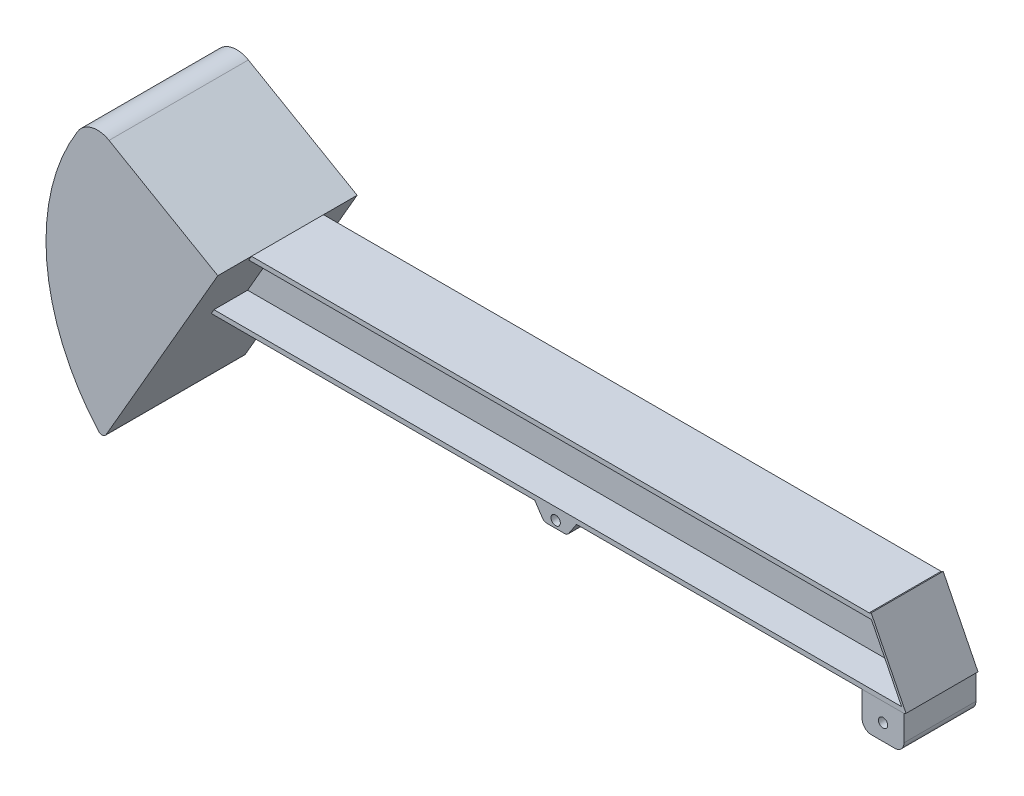
ISO-10303-21;
HEADER;
FILE_DESCRIPTION(('STEP AP214'),'2;1');
FILE_NAME('part.step','',(''),(''),'','','');
FILE_SCHEMA(('AUTOMOTIVE_DESIGN { 1 0 10303 214 1 1 1 1 }'));
ENDSEC;
DATA;
#1=APPLICATION_CONTEXT('core data for automotive mechanical design processes');
#2=APPLICATION_PROTOCOL_DEFINITION('international standard','automotive_design',2000,#1);
#3=PRODUCT_CONTEXT('',#1,'mechanical');
#4=PRODUCT('Part','Part','',(#3));
#5=PRODUCT_RELATED_PRODUCT_CATEGORY('part','',(#4));
#6=PRODUCT_DEFINITION_FORMATION('','',#4);
#7=PRODUCT_DEFINITION_CONTEXT('part definition',#1,'design');
#8=PRODUCT_DEFINITION('design','',#6,#7);
#9=PRODUCT_DEFINITION_SHAPE('','',#8);
#10=(LENGTH_UNIT() NAMED_UNIT(*) SI_UNIT(.MILLI.,.METRE.));
#11=(NAMED_UNIT(*) PLANE_ANGLE_UNIT() SI_UNIT($,.RADIAN.));
#12=(NAMED_UNIT(*) SI_UNIT($,.STERADIAN.) SOLID_ANGLE_UNIT());
#13=UNCERTAINTY_MEASURE_WITH_UNIT(LENGTH_MEASURE(1.E-05),#10,'distance_accuracy_value','');
#14=(GEOMETRIC_REPRESENTATION_CONTEXT(3) GLOBAL_UNCERTAINTY_ASSIGNED_CONTEXT((#13)) GLOBAL_UNIT_ASSIGNED_CONTEXT((#10,
#11,#12)) REPRESENTATION_CONTEXT('',''));
#15=CARTESIAN_POINT('',(0.,0.,0.));
#16=DIRECTION('',(0.,0.,1.));
#17=DIRECTION('',(1.,0.,0.));
#18=AXIS2_PLACEMENT_3D('',#15,#16,#17);
#19=CARTESIAN_POINT('',(-750.,140.,-77.5));
#20=DIRECTION('',(0.,0.,-1.));
#21=DIRECTION('',(-1.,0.,0.));
#22=AXIS2_PLACEMENT_3D('',#19,#20,#21);
#23=PLANE('',#22);
#24=CARTESIAN_POINT('',(705.,-40.,-77.5));
#25=DIRECTION('',(0.,0.,-1.));
#26=DIRECTION('',(-1.,0.,0.));
#27=AXIS2_PLACEMENT_3D('',#24,#25,#26);
#28=CIRCLE('',#27,9.99999999999998);
#29=CARTESIAN_POINT('',(695.,-40.,-77.5));
#30=VERTEX_POINT('',#29);
#31=EDGE_CURVE('E160',#30,#30,#28,.T.);
#32=ORIENTED_EDGE('',*,*,#31,.F.);
#33=EDGE_LOOP('',(#32));
#34=FACE_BOUND('',#33,.T.);
#35=DIRECTION('',(1.,0.,0.));
#36=VECTOR('',#35,1.);
#37=CARTESIAN_POINT('',(660.,-75.,-77.5));
#38=LINE('',#37,#36);
#39=CARTESIAN_POINT('',(680.,-75.,-77.5));
#40=VERTEX_POINT('',#39);
#41=CARTESIAN_POINT('',(730.,-75.,-77.5));
#42=VERTEX_POINT('',#41);
#43=EDGE_CURVE('E111',#40,#42,#38,.T.);
#44=ORIENTED_EDGE('',*,*,#43,.F.);
#45=CARTESIAN_POINT('',(680.,-55.,-77.5));
#46=DIRECTION('',(0.,0.,-1.));
#47=DIRECTION('',(-1.,0.,0.));
#48=AXIS2_PLACEMENT_3D('',#45,#46,#47);
#49=CIRCLE('',#48,20.);
#50=CARTESIAN_POINT('',(660.,-55.,-77.5));
#51=VERTEX_POINT('',#50);
#52=EDGE_CURVE('E58',#40,#51,#49,.T.);
#53=ORIENTED_EDGE('',*,*,#52,.T.);
#54=DIRECTION('',(0.,-1.,0.));
#55=VECTOR('',#54,1.);
#56=CARTESIAN_POINT('',(660.,0.,-77.5));
#57=LINE('',#56,#55);
#58=CARTESIAN_POINT('',(660.,0.,-77.5));
#59=VERTEX_POINT('',#58);
#60=EDGE_CURVE('E102',#59,#51,#57,.T.);
#61=ORIENTED_EDGE('',*,*,#60,.F.);
#62=DIRECTION('',(-1.,0.,0.));
#63=VECTOR('',#62,1.);
#64=CARTESIAN_POINT('',(750.,0.,-77.5));
#65=LINE('',#64,#63);
#66=CARTESIAN_POINT('',(750.,0.,-77.5));
#67=VERTEX_POINT('',#66);
#68=EDGE_CURVE('E105',#67,#59,#65,.T.);
#69=ORIENTED_EDGE('',*,*,#68,.F.);
#70=DIRECTION('',(0.,1.,0.));
#71=VECTOR('',#70,1.);
#72=CARTESIAN_POINT('',(750.,-75.,-77.5));
#73=LINE('',#72,#71);
#74=CARTESIAN_POINT('',(750.,-55.,-77.5));
#75=VERTEX_POINT('',#74);
#76=EDGE_CURVE('E133',#75,#67,#73,.T.);
#77=ORIENTED_EDGE('',*,*,#76,.F.);
#78=CARTESIAN_POINT('',(730.,-55.,-77.5));
#79=DIRECTION('',(0.,0.,-1.));
#80=DIRECTION('',(-1.,0.,0.));
#81=AXIS2_PLACEMENT_3D('',#78,#79,#80);
#82=CIRCLE('',#81,20.);
#83=EDGE_CURVE('E70',#75,#42,#82,.T.);
#84=ORIENTED_EDGE('',*,*,#83,.T.);
#85=EDGE_LOOP('',(#44,#53,#61,#69,#77,#84));
#86=FACE_BOUND('',#85,.T.);
#87=ADVANCED_FACE('F50',(#34,#86),#23,.T.);
#88=CARTESIAN_POINT('',(0.,0.,77.5));
#89=DIRECTION('',(0.,0.,1.));
#90=DIRECTION('',(1.,0.,0.));
#91=AXIS2_PLACEMENT_3D('',#88,#89,#90);
#92=PLANE('',#91);
#93=CARTESIAN_POINT('',(705.,-40.,77.5));
#94=DIRECTION('',(0.,0.,1.));
#95=DIRECTION('',(1.,0.,0.));
#96=AXIS2_PLACEMENT_3D('',#93,#94,#95);
#97=CIRCLE('',#96,9.99999999999998);
#98=CARTESIAN_POINT('',(715.,-40.,77.5));
#99=VERTEX_POINT('',#98);
#100=EDGE_CURVE('E163',#99,#99,#97,.T.);
#101=ORIENTED_EDGE('',*,*,#100,.F.);
#102=EDGE_LOOP('',(#101));
#103=FACE_BOUND('',#102,.T.);
#104=DIRECTION('',(0.,-1.,0.));
#105=VECTOR('',#104,1.);
#106=CARTESIAN_POINT('',(660.,0.,77.5));
#107=LINE('',#106,#105);
#108=CARTESIAN_POINT('',(660.,0.,77.5));
#109=VERTEX_POINT('',#108);
#110=CARTESIAN_POINT('',(660.,-55.,77.5));
#111=VERTEX_POINT('',#110);
#112=EDGE_CURVE('E117',#109,#111,#107,.T.);
#113=ORIENTED_EDGE('',*,*,#112,.T.);
#114=CARTESIAN_POINT('',(680.,-55.,77.5));
#115=DIRECTION('',(0.,0.,1.));
#116=DIRECTION('',(1.,0.,0.));
#117=AXIS2_PLACEMENT_3D('',#114,#115,#116);
#118=CIRCLE('',#117,20.);
#119=CARTESIAN_POINT('',(680.,-75.,77.5));
#120=VERTEX_POINT('',#119);
#121=EDGE_CURVE('E141',#111,#120,#118,.T.);
#122=ORIENTED_EDGE('',*,*,#121,.T.);
#123=DIRECTION('',(1.,0.,0.));
#124=VECTOR('',#123,1.);
#125=CARTESIAN_POINT('',(660.,-75.,77.5));
#126=LINE('',#125,#124);
#127=CARTESIAN_POINT('',(730.,-75.,77.5));
#128=VERTEX_POINT('',#127);
#129=EDGE_CURVE('E125',#120,#128,#126,.T.);
#130=ORIENTED_EDGE('',*,*,#129,.T.);
#131=CARTESIAN_POINT('',(730.,-55.,77.5));
#132=DIRECTION('',(0.,0.,1.));
#133=DIRECTION('',(1.,0.,0.));
#134=AXIS2_PLACEMENT_3D('',#131,#132,#133);
#135=CIRCLE('',#134,20.);
#136=CARTESIAN_POINT('',(750.,-55.,77.5));
#137=VERTEX_POINT('',#136);
#138=EDGE_CURVE('E139',#128,#137,#135,.T.);
#139=ORIENTED_EDGE('',*,*,#138,.T.);
#140=DIRECTION('',(0.,1.,0.));
#141=VECTOR('',#140,1.);
#142=CARTESIAN_POINT('',(750.,-75.,77.5));
#143=LINE('',#142,#141);
#144=CARTESIAN_POINT('',(750.,0.,77.5));
#145=VERTEX_POINT('',#144);
#146=EDGE_CURVE('E131',#137,#145,#143,.T.);
#147=ORIENTED_EDGE('',*,*,#146,.T.);
#148=DIRECTION('',(-1.,0.,0.));
#149=VECTOR('',#148,1.);
#150=CARTESIAN_POINT('',(750.,0.,77.5));
#151=LINE('',#150,#149);
#152=EDGE_CURVE('E157',#145,#109,#151,.T.);
#153=ORIENTED_EDGE('',*,*,#152,.T.);
#154=EDGE_LOOP('',(#113,#122,#130,#139,#147,#153));
#155=FACE_BOUND('',#154,.T.);
#156=ADVANCED_FACE('F156',(#103,#155),#92,.T.);
#157=CARTESIAN_POINT('',(750.,0.,-194.6537451386));
#158=DIRECTION('',(0.,1.,0.));
#159=DIRECTION('',(-1.,0.,0.));
#160=AXIS2_PLACEMENT_3D('',#157,#158,#159);
#161=PLANE('',#160);
#162=DIRECTION('',(0.,0.,1.));
#163=VECTOR('',#162,1.);
#164=CARTESIAN_POINT('',(750.,0.,-194.6537451386));
#165=LINE('',#164,#163);
#166=EDGE_CURVE('E124',#67,#145,#165,.T.);
#167=ORIENTED_EDGE('',*,*,#166,.F.);
#168=ORIENTED_EDGE('',*,*,#68,.T.);
#169=DIRECTION('',(0.,0.,1.));
#170=VECTOR('',#169,1.);
#171=CARTESIAN_POINT('',(660.,0.,-194.6537451386));
#172=LINE('',#171,#170);
#173=EDGE_CURVE('E112',#59,#109,#172,.T.);
#174=ORIENTED_EDGE('',*,*,#173,.T.);
#175=ORIENTED_EDGE('',*,*,#152,.F.);
#176=EDGE_LOOP('',(#167,#168,#174,#175));
#177=FACE_BOUND('',#176,.T.);
#178=ADVANCED_FACE('F122',(#177),#161,.T.);
#179=CARTESIAN_POINT('',(660.,0.,-194.6537451386));
#180=DIRECTION('',(-1.,0.,0.));
#181=DIRECTION('',(0.,0.,1.));
#182=AXIS2_PLACEMENT_3D('',#179,#180,#181);
#183=PLANE('',#182);
#184=ORIENTED_EDGE('',*,*,#60,.T.);
#185=DIRECTION('',(0.,0.,1.));
#186=VECTOR('',#185,1.);
#187=CARTESIAN_POINT('',(660.,-55.,-194.6537451386));
#188=LINE('',#187,#186);
#189=EDGE_CURVE('E137',#51,#111,#188,.T.);
#190=ORIENTED_EDGE('',*,*,#189,.T.);
#191=ORIENTED_EDGE('',*,*,#112,.F.);
#192=ORIENTED_EDGE('',*,*,#173,.F.);
#193=EDGE_LOOP('',(#184,#190,#191,#192));
#194=FACE_BOUND('',#193,.T.);
#195=ADVANCED_FACE('F115',(#194),#183,.T.);
#196=CARTESIAN_POINT('',(660.,-75.,-194.6537451386));
#197=DIRECTION('',(0.,-1.,0.));
#198=DIRECTION('',(0.,0.,-1.));
#199=AXIS2_PLACEMENT_3D('',#196,#197,#198);
#200=PLANE('',#199);
#201=ORIENTED_EDGE('',*,*,#129,.F.);
#202=DIRECTION('',(0.,0.,1.));
#203=VECTOR('',#202,1.);
#204=CARTESIAN_POINT('',(680.,-75.,-194.6537451386));
#205=LINE('',#204,#203);
#206=EDGE_CURVE('E146',#120,#40,#205,.F.);
#207=ORIENTED_EDGE('',*,*,#206,.T.);
#208=ORIENTED_EDGE('',*,*,#43,.T.);
#209=DIRECTION('',(0.,0.,1.));
#210=VECTOR('',#209,1.);
#211=CARTESIAN_POINT('',(730.,-75.,-194.6537451386));
#212=LINE('',#211,#210);
#213=EDGE_CURVE('E143',#42,#128,#212,.T.);
#214=ORIENTED_EDGE('',*,*,#213,.T.);
#215=EDGE_LOOP('',(#201,#207,#208,#214));
#216=FACE_BOUND('',#215,.T.);
#217=ADVANCED_FACE('F151',(#216),#200,.T.);
#218=CARTESIAN_POINT('',(750.,-75.,-194.6537451386));
#219=DIRECTION('',(1.,0.,0.));
#220=DIRECTION('',(0.,0.,-1.));
#221=AXIS2_PLACEMENT_3D('',#218,#219,#220);
#222=PLANE('',#221);
#223=ORIENTED_EDGE('',*,*,#146,.F.);
#224=DIRECTION('',(0.,0.,1.));
#225=VECTOR('',#224,1.);
#226=CARTESIAN_POINT('',(750.,-55.,-194.6537451386));
#227=LINE('',#226,#225);
#228=EDGE_CURVE('E12',#137,#75,#227,.F.);
#229=ORIENTED_EDGE('',*,*,#228,.T.);
#230=ORIENTED_EDGE('',*,*,#76,.T.);
#231=ORIENTED_EDGE('',*,*,#166,.T.);
#232=EDGE_LOOP('',(#223,#229,#230,#231));
#233=FACE_BOUND('',#232,.T.);
#234=ADVANCED_FACE('F180',(#233),#222,.T.);
#235=CARTESIAN_POINT('',(680.,-55.,-194.6537451386));
#236=DIRECTION('',(0.,0.,1.));
#237=DIRECTION('',(1.,0.,0.));
#238=AXIS2_PLACEMENT_3D('',#235,#236,#237);
#239=CYLINDRICAL_SURFACE('',#238,20.);
#240=ORIENTED_EDGE('',*,*,#52,.F.);
#241=ORIENTED_EDGE('',*,*,#206,.F.);
#242=ORIENTED_EDGE('',*,*,#121,.F.);
#243=ORIENTED_EDGE('',*,*,#189,.F.);
#244=EDGE_LOOP('',(#240,#241,#242,#243));
#245=FACE_BOUND('',#244,.T.);
#246=ADVANCED_FACE('F154',(#245),#239,.T.);
#247=CARTESIAN_POINT('',(730.,-55.,-194.6537451386));
#248=DIRECTION('',(0.,0.,1.));
#249=DIRECTION('',(1.,0.,0.));
#250=AXIS2_PLACEMENT_3D('',#247,#248,#249);
#251=CYLINDRICAL_SURFACE('',#250,20.);
#252=ORIENTED_EDGE('',*,*,#83,.F.);
#253=ORIENTED_EDGE('',*,*,#228,.F.);
#254=ORIENTED_EDGE('',*,*,#138,.F.);
#255=ORIENTED_EDGE('',*,*,#213,.F.);
#256=EDGE_LOOP('',(#252,#253,#254,#255));
#257=FACE_BOUND('',#256,.T.);
#258=ADVANCED_FACE('F52',(#257),#251,.T.);
#259=CARTESIAN_POINT('',(705.,-40.,-150.));
#260=DIRECTION('',(0.,0.,1.));
#261=DIRECTION('',(1.,0.,0.));
#262=AXIS2_PLACEMENT_3D('',#259,#260,#261);
#263=CYLINDRICAL_SURFACE('',#262,9.99999999999998);
#264=ORIENTED_EDGE('',*,*,#31,.T.);
#265=EDGE_LOOP('',(#264));
#266=FACE_BOUND('',#265,.T.);
#267=ORIENTED_EDGE('',*,*,#100,.T.);
#268=EDGE_LOOP('',(#267));
#269=FACE_BOUND('',#268,.T.);
#270=ADVANCED_FACE('F167',(#266,#269),#263,.F.);
#271=CLOSED_SHELL('',(#87,#156,#178,#195,#217,#234,#246,#258,#270));
#272=MANIFOLD_SOLID_BREP('B2',#271);
#273=CARTESIAN_POINT('',(-750.,0.,77.5));
#274=DIRECTION('',(0.,-1.,0.));
#275=DIRECTION('',(0.,0.,-1.));
#276=AXIS2_PLACEMENT_3D('',#273,#274,#275);
#277=PLANE('',#276);
#278=DIRECTION('',(1.,0.,0.));
#279=VECTOR('',#278,1.);
#280=CARTESIAN_POINT('',(-750.,0.,77.5));
#281=LINE('',#280,#279);
#282=CARTESIAN_POINT('',(-741.602540378445,0.,77.5));
#283=VERTEX_POINT('',#282);
#284=CARTESIAN_POINT('',(-45.,0.,77.5));
#285=VERTEX_POINT('',#284);
#286=EDGE_CURVE('E551',#283,#285,#281,.T.);
#287=ORIENTED_EDGE('',*,*,#286,.F.);
#288=DIRECTION('',(0.,0.,-1.));
#289=VECTOR('',#288,1.);
#290=CARTESIAN_POINT('',(-741.602540378445,0.,77.5));
#291=LINE('',#290,#289);
#292=CARTESIAN_POINT('',(-741.602540378445,0.,-77.5));
#293=VERTEX_POINT('',#292);
#294=EDGE_CURVE('E501',#283,#293,#291,.T.);
#295=ORIENTED_EDGE('',*,*,#294,.T.);
#296=DIRECTION('',(1.,0.,0.));
#297=VECTOR('',#296,1.);
#298=CARTESIAN_POINT('',(-750.,0.,-77.5));
#299=LINE('',#298,#297);
#300=CARTESIAN_POINT('',(-45.,0.,-77.5));
#301=VERTEX_POINT('',#300);
#302=EDGE_CURVE('E548',#293,#301,#299,.T.);
#303=ORIENTED_EDGE('',*,*,#302,.T.);
#304=DIRECTION('',(0.,0.,-1.));
#305=VECTOR('',#304,1.);
#306=CARTESIAN_POINT('',(-45.,0.,77.5));
#307=LINE('',#306,#305);
#308=EDGE_CURVE('E568',#285,#301,#307,.T.);
#309=ORIENTED_EDGE('',*,*,#308,.F.);
#310=EDGE_LOOP('',(#287,#295,#303,#309));
#311=FACE_BOUND('',#310,.T.);
#312=ADVANCED_FACE('F250',(#311),#277,.T.);
#313=CARTESIAN_POINT('',(-750.,9.99999999999999,5.));
#314=DIRECTION('',(0.,1.,0.));
#315=DIRECTION('',(0.,0.,1.));
#316=AXIS2_PLACEMENT_3D('',#313,#314,#315);
#317=PLANE('',#316);
#318=DIRECTION('',(0.,0.,1.));
#319=VECTOR('',#318,1.);
#320=CARTESIAN_POINT('',(745.,9.99999999999999,4.99999999999991));
#321=LINE('',#320,#319);
#322=CARTESIAN_POINT('',(745.,10.,5.));
#323=VERTEX_POINT('',#322);
#324=CARTESIAN_POINT('',(745.,9.99999999999998,77.5));
#325=VERTEX_POINT('',#324);
#326=EDGE_CURVE('E468',#323,#325,#321,.T.);
#327=ORIENTED_EDGE('',*,*,#326,.F.);
#328=DIRECTION('',(1.,0.,0.));
#329=VECTOR('',#328,1.);
#330=CARTESIAN_POINT('',(-750.,9.99999999999999,5.));
#331=LINE('',#330,#329);
#332=CARTESIAN_POINT('',(-735.829037686549,9.99999999999999,5.));
#333=VERTEX_POINT('',#332);
#334=EDGE_CURVE('E524',#333,#323,#331,.T.);
#335=ORIENTED_EDGE('',*,*,#334,.F.);
#336=DIRECTION('',(0.,0.,1.));
#337=VECTOR('',#336,1.);
#338=CARTESIAN_POINT('',(-735.829037686549,9.99999999999999,5.));
#339=LINE('',#338,#337);
#340=CARTESIAN_POINT('',(-735.829037686549,9.99999999999995,77.5));
#341=VERTEX_POINT('',#340);
#342=EDGE_CURVE('E507',#333,#341,#339,.T.);
#343=ORIENTED_EDGE('',*,*,#342,.T.);
#344=DIRECTION('',(1.,0.,0.));
#345=VECTOR('',#344,1.);
#346=CARTESIAN_POINT('',(-750.,9.99999999999998,77.5));
#347=LINE('',#346,#345);
#348=EDGE_CURVE('E521',#341,#325,#347,.T.);
#349=ORIENTED_EDGE('',*,*,#348,.T.);
#350=EDGE_LOOP('',(#327,#335,#343,#349));
#351=FACE_BOUND('',#350,.T.);
#352=ADVANCED_FACE('F675',(#351),#317,.T.);
#353=CARTESIAN_POINT('',(-750.,140.,5.00000000000002));
#354=DIRECTION('',(0.,0.,1.));
#355=DIRECTION('',(0.,-1.,0.));
#356=AXIS2_PLACEMENT_3D('',#353,#354,#355);
#357=PLANE('',#356);
#358=DIRECTION('',(0.447213595499958,-0.894427190999916,0.));
#359=VECTOR('',#358,1.);
#360=CARTESIAN_POINT('',(394.,712.,5.0000000000001));
#361=LINE('',#360,#359);
#362=CARTESIAN_POINT('',(680.,140.,5.00000000000002));
#363=VERTEX_POINT('',#362);
#364=EDGE_CURVE('E465',#363,#323,#361,.T.);
#365=ORIENTED_EDGE('',*,*,#364,.F.);
#366=DIRECTION('',(1.,0.,0.));
#367=VECTOR('',#366,1.);
#368=CARTESIAN_POINT('',(-750.,140.,5.00000000000002));
#369=LINE('',#368,#367);
#370=CARTESIAN_POINT('',(-660.773502691896,140.,5.00000000000002));
#371=VERTEX_POINT('',#370);
#372=EDGE_CURVE('E527',#371,#363,#369,.T.);
#373=ORIENTED_EDGE('',*,*,#372,.F.);
#374=DIRECTION('',(-0.500000000000004,-0.866025403784436,0.));
#375=VECTOR('',#374,1.);
#376=CARTESIAN_POINT('',(-683.080127018923,101.363793320239,5.00000000000001));
#377=LINE('',#376,#375);
#378=EDGE_CURVE('E510',#371,#333,#377,.T.);
#379=ORIENTED_EDGE('',*,*,#378,.T.);
#380=ORIENTED_EDGE('',*,*,#334,.T.);
#381=EDGE_LOOP('',(#365,#373,#379,#380));
#382=FACE_BOUND('',#381,.T.);
#383=ADVANCED_FACE('F682',(#382),#357,.T.);
#384=CARTESIAN_POINT('',(-750.,140.,77.5));
#385=DIRECTION('',(0.,-1.,0.));
#386=DIRECTION('',(0.,0.,-1.));
#387=AXIS2_PLACEMENT_3D('',#384,#385,#386);
#388=PLANE('',#387);
#389=DIRECTION('',(0.,0.,-1.));
#390=VECTOR('',#389,1.);
#391=CARTESIAN_POINT('',(680.,140.,77.5));
#392=LINE('',#391,#390);
#393=CARTESIAN_POINT('',(680.,140.,77.5));
#394=VERTEX_POINT('',#393);
#395=EDGE_CURVE('E462',#394,#363,#392,.T.);
#396=ORIENTED_EDGE('',*,*,#395,.F.);
#397=DIRECTION('',(1.,0.,0.));
#398=VECTOR('',#397,1.);
#399=CARTESIAN_POINT('',(-750.,140.,77.5));
#400=LINE('',#399,#398);
#401=CARTESIAN_POINT('',(-660.773502691896,140.,77.5));
#402=VERTEX_POINT('',#401);
#403=EDGE_CURVE('E530',#402,#394,#400,.T.);
#404=ORIENTED_EDGE('',*,*,#403,.F.);
#405=DIRECTION('',(0.,0.,-1.));
#406=VECTOR('',#405,1.);
#407=CARTESIAN_POINT('',(-660.773502691896,140.,77.5));
#408=LINE('',#407,#406);
#409=EDGE_CURVE('E513',#402,#371,#408,.T.);
#410=ORIENTED_EDGE('',*,*,#409,.T.);
#411=ORIENTED_EDGE('',*,*,#372,.T.);
#412=EDGE_LOOP('',(#396,#404,#410,#411));
#413=FACE_BOUND('',#412,.T.);
#414=ADVANCED_FACE('F641',(#413),#388,.T.);
#415=CARTESIAN_POINT('',(-750.,150.,77.5));
#416=DIRECTION('',(0.,0.,1.));
#417=DIRECTION('',(1.,0.,0.));
#418=AXIS2_PLACEMENT_3D('',#415,#416,#417);
#419=PLANE('',#418);
#420=ORIENTED_EDGE('',*,*,#403,.T.);
#421=DIRECTION('',(0.447213595499958,-0.894427190999916,0.));
#422=VECTOR('',#421,1.);
#423=CARTESIAN_POINT('',(675.,150.,77.5));
#424=LINE('',#423,#422);
#425=EDGE_CURVE('E645',#394,#325,#424,.T.);
#426=ORIENTED_EDGE('',*,*,#425,.T.);
#427=ORIENTED_EDGE('',*,*,#348,.F.);
#428=DIRECTION('',(-0.500000000000004,-0.866025403784436,0.));
#429=VECTOR('',#428,1.);
#430=CARTESIAN_POINT('',(-556.201905283831,321.123319739406,77.5));
#431=LINE('',#430,#429);
#432=EDGE_CURVE('E504',#341,#283,#431,.T.);
#433=ORIENTED_EDGE('',*,*,#432,.T.);
#434=ORIENTED_EDGE('',*,*,#286,.T.);
#435=DIRECTION('',(0.554700196225229,-0.832050294337844,0.));
#436=VECTOR('',#435,1.);
#437=CARTESIAN_POINT('',(-45.,0.,77.5));
#438=LINE('',#437,#436);
#439=CARTESIAN_POINT('',(-27.9686653584985,-25.5470019622523,77.5));
#440=VERTEX_POINT('',#439);
#441=EDGE_CURVE('E559',#285,#440,#438,.T.);
#442=ORIENTED_EDGE('',*,*,#441,.T.);
#443=CARTESIAN_POINT('',(-19.64816241512,-20.,77.5));
#444=DIRECTION('',(0.,0.,1.));
#445=DIRECTION('',(1.,0.,0.));
#446=AXIS2_PLACEMENT_3D('',#443,#444,#445);
#447=CIRCLE('',#446,10.);
#448=CARTESIAN_POINT('',(-19.64816241512,-30.,77.5));
#449=VERTEX_POINT('',#448);
#450=EDGE_CURVE('E592',#440,#449,#447,.T.);
#451=ORIENTED_EDGE('',*,*,#450,.T.);
#452=DIRECTION('',(1.,0.,0.));
#453=VECTOR('',#452,1.);
#454=CARTESIAN_POINT('',(-25.,-30.,77.5));
#455=LINE('',#454,#453);
#456=CARTESIAN_POINT('',(19.64816241512,-30.,77.5));
#457=VERTEX_POINT('',#456);
#458=EDGE_CURVE('E562',#449,#457,#455,.T.);
#459=ORIENTED_EDGE('',*,*,#458,.T.);
#460=CARTESIAN_POINT('',(19.64816241512,-20.,77.5));
#461=DIRECTION('',(0.,0.,1.));
#462=DIRECTION('',(1.,0.,0.));
#463=AXIS2_PLACEMENT_3D('',#460,#461,#462);
#464=CIRCLE('',#463,10.);
#465=CARTESIAN_POINT('',(27.9686653584985,-25.5470019622523,77.5));
#466=VERTEX_POINT('',#465);
#467=EDGE_CURVE('E594',#457,#466,#464,.T.);
#468=ORIENTED_EDGE('',*,*,#467,.T.);
#469=DIRECTION('',(0.554700196225229,0.832050294337844,0.));
#470=VECTOR('',#469,1.);
#471=CARTESIAN_POINT('',(25.,-30.,77.5));
#472=LINE('',#471,#470);
#473=CARTESIAN_POINT('',(45.,0.,77.5));
#474=VERTEX_POINT('',#473);
#475=EDGE_CURVE('E566',#466,#474,#472,.T.);
#476=ORIENTED_EDGE('',*,*,#475,.T.);
#477=CARTESIAN_POINT('',(750.,0.,77.5));
#478=VERTEX_POINT('',#477);
#479=EDGE_CURVE('E443',#474,#478,#281,.T.);
#480=ORIENTED_EDGE('',*,*,#479,.T.);
#481=DIRECTION('',(-0.894427190999916,-0.447213595499958,0.));
#482=VECTOR('',#481,1.);
#483=CARTESIAN_POINT('',(754.472135955,2.23606797749984,77.5));
#484=LINE('',#483,#482);
#485=CARTESIAN_POINT('',(754.472135955,2.23606797749984,77.5));
#486=VERTEX_POINT('',#485);
#487=EDGE_CURVE('E422',#486,#478,#484,.T.);
#488=ORIENTED_EDGE('',*,*,#487,.F.);
#489=DIRECTION('',(0.447213595499958,-0.894427190999916,0.));
#490=VECTOR('',#489,1.);
#491=CARTESIAN_POINT('',(679.472135955,152.2360679775,77.5));
#492=LINE('',#491,#490);
#493=CARTESIAN_POINT('',(679.472135955,152.2360679775,77.5));
#494=VERTEX_POINT('',#493);
#495=EDGE_CURVE('E428',#494,#486,#492,.T.);
#496=ORIENTED_EDGE('',*,*,#495,.F.);
#497=DIRECTION('',(-0.894427190999916,-0.447213595499958,0.));
#498=VECTOR('',#497,1.);
#499=CARTESIAN_POINT('',(679.472135955,152.2360679775,77.5));
#500=LINE('',#499,#498);
#501=CARTESIAN_POINT('',(675.,150.,77.5));
#502=VERTEX_POINT('',#501);
#503=EDGE_CURVE('E653',#494,#502,#500,.T.);
#504=ORIENTED_EDGE('',*,*,#503,.T.);
#505=DIRECTION('',(1.,0.,0.));
#506=VECTOR('',#505,1.);
#507=CARTESIAN_POINT('',(-750.,150.,77.5));
#508=LINE('',#507,#506);
#509=CARTESIAN_POINT('',(-655.,150.,77.5));
#510=VERTEX_POINT('',#509);
#511=EDGE_CURVE('E532',#510,#502,#508,.T.);
#512=ORIENTED_EDGE('',*,*,#511,.F.);
#513=DIRECTION('',(-0.500000000000004,-0.866025403784436,0.));
#514=VECTOR('',#513,1.);
#515=CARTESIAN_POINT('',(-678.75,108.863793320239,77.5));
#516=LINE('',#515,#514);
#517=EDGE_CURVE('E516',#510,#402,#516,.T.);
#518=ORIENTED_EDGE('',*,*,#517,.T.);
#519=EDGE_LOOP('',(#420,#426,#427,#433,#434,#442,#451,#459,#468,#476,#480,#488,#496,#504,#512,#518));
#520=FACE_BOUND('',#519,.T.);
#521=CARTESIAN_POINT('',(0.,-15.,77.5));
#522=DIRECTION('',(0.,0.,1.));
#523=DIRECTION('',(1.,0.,0.));
#524=AXIS2_PLACEMENT_3D('',#521,#522,#523);
#525=CIRCLE('',#524,10.);
#526=CARTESIAN_POINT('',(10.,-15.,77.5));
#527=VERTEX_POINT('',#526);
#528=EDGE_CURVE('E523',#527,#527,#525,.T.);
#529=ORIENTED_EDGE('',*,*,#528,.F.);
#530=EDGE_LOOP('',(#529));
#531=FACE_BOUND('',#530,.T.);
#532=ADVANCED_FACE('F440',(#520,#531),#419,.T.);
#533=CARTESIAN_POINT('',(-750.,150.,-77.5));
#534=DIRECTION('',(0.,1.,0.));
#535=DIRECTION('',(0.,0.,1.));
#536=AXIS2_PLACEMENT_3D('',#533,#534,#535);
#537=PLANE('',#536);
#538=DIRECTION('',(0.,0.,1.));
#539=VECTOR('',#538,1.);
#540=CARTESIAN_POINT('',(675.,150.,-145.));
#541=LINE('',#540,#539);
#542=CARTESIAN_POINT('',(675.,150.,-77.5));
#543=VERTEX_POINT('',#542);
#544=EDGE_CURVE('E445',#543,#502,#541,.T.);
#545=ORIENTED_EDGE('',*,*,#544,.F.);
#546=DIRECTION('',(1.,0.,0.));
#547=VECTOR('',#546,1.);
#548=CARTESIAN_POINT('',(-750.,150.,-77.5));
#549=LINE('',#548,#547);
#550=CARTESIAN_POINT('',(-655.,150.,-77.5));
#551=VERTEX_POINT('',#550);
#552=EDGE_CURVE('E534',#551,#543,#549,.T.);
#553=ORIENTED_EDGE('',*,*,#552,.F.);
#554=DIRECTION('',(0.,0.,-1.));
#555=VECTOR('',#554,1.);
#556=CARTESIAN_POINT('',(-655.,150.,150.));
#557=LINE('',#556,#555);
#558=EDGE_CURVE('E490',#510,#551,#557,.T.);
#559=ORIENTED_EDGE('',*,*,#558,.F.);
#560=ORIENTED_EDGE('',*,*,#511,.T.);
#561=EDGE_LOOP('',(#545,#553,#559,#560));
#562=FACE_BOUND('',#561,.T.);
#563=ADVANCED_FACE('F664',(#562),#537,.T.);
#564=CARTESIAN_POINT('',(-750.,140.,-77.5));
#565=DIRECTION('',(0.,0.,-1.));
#566=DIRECTION('',(-1.,0.,0.));
#567=AXIS2_PLACEMENT_3D('',#564,#565,#566);
#568=PLANE('',#567);
#569=ORIENTED_EDGE('',*,*,#552,.T.);
#570=DIRECTION('',(-0.894427190999916,-0.447213595499958,0.));
#571=VECTOR('',#570,1.);
#572=CARTESIAN_POINT('',(679.472135955,152.2360679775,-77.5));
#573=LINE('',#572,#571);
#574=CARTESIAN_POINT('',(679.472135955,152.2360679775,-77.5));
#575=VERTEX_POINT('',#574);
#576=EDGE_CURVE('E450',#575,#543,#573,.T.);
#577=ORIENTED_EDGE('',*,*,#576,.F.);
#578=DIRECTION('',(-0.447213595499958,0.894427190999916,0.));
#579=VECTOR('',#578,1.);
#580=CARTESIAN_POINT('',(679.472135955,152.2360679775,-77.5));
#581=LINE('',#580,#579);
#582=CARTESIAN_POINT('',(754.472135955,2.23606797749984,-77.5));
#583=VERTEX_POINT('',#582);
#584=EDGE_CURVE('E427',#583,#575,#581,.T.);
#585=ORIENTED_EDGE('',*,*,#584,.F.);
#586=DIRECTION('',(-0.894427190999916,-0.447213595499958,0.));
#587=VECTOR('',#586,1.);
#588=CARTESIAN_POINT('',(754.472135955,2.23606797749984,-77.5));
#589=LINE('',#588,#587);
#590=CARTESIAN_POINT('',(750.,0.,-77.5));
#591=VERTEX_POINT('',#590);
#592=EDGE_CURVE('E424',#583,#591,#589,.T.);
#593=ORIENTED_EDGE('',*,*,#592,.T.);
#594=CARTESIAN_POINT('',(45.,0.,-77.5));
#595=VERTEX_POINT('',#594);
#596=EDGE_CURVE('E550',#595,#591,#299,.T.);
#597=ORIENTED_EDGE('',*,*,#596,.F.);
#598=DIRECTION('',(0.554700196225229,0.832050294337844,0.));
#599=VECTOR('',#598,1.);
#600=CARTESIAN_POINT('',(25.,-30.,-77.5));
#601=LINE('',#600,#599);
#602=CARTESIAN_POINT('',(27.9686653584985,-25.5470019622523,-77.5));
#603=VERTEX_POINT('',#602);
#604=EDGE_CURVE('E563',#603,#595,#601,.T.);
#605=ORIENTED_EDGE('',*,*,#604,.F.);
#606=CARTESIAN_POINT('',(19.64816241512,-20.,-77.5));
#607=DIRECTION('',(0.,0.,1.));
#608=DIRECTION('',(1.,0.,0.));
#609=AXIS2_PLACEMENT_3D('',#606,#607,#608);
#610=CIRCLE('',#609,10.);
#611=CARTESIAN_POINT('',(19.64816241512,-30.,-77.5));
#612=VERTEX_POINT('',#611);
#613=EDGE_CURVE('E585',#603,#612,#610,.F.);
#614=ORIENTED_EDGE('',*,*,#613,.T.);
#615=DIRECTION('',(1.,0.,0.));
#616=VECTOR('',#615,1.);
#617=CARTESIAN_POINT('',(-25.,-30.,-77.5));
#618=LINE('',#617,#616);
#619=CARTESIAN_POINT('',(-19.64816241512,-30.,-77.5));
#620=VERTEX_POINT('',#619);
#621=EDGE_CURVE('E571',#620,#612,#618,.T.);
#622=ORIENTED_EDGE('',*,*,#621,.F.);
#623=CARTESIAN_POINT('',(-19.64816241512,-20.,-77.5));
#624=DIRECTION('',(0.,0.,1.));
#625=DIRECTION('',(1.,0.,0.));
#626=AXIS2_PLACEMENT_3D('',#623,#624,#625);
#627=CIRCLE('',#626,10.);
#628=CARTESIAN_POINT('',(-27.9686653584985,-25.5470019622523,-77.5));
#629=VERTEX_POINT('',#628);
#630=EDGE_CURVE('E583',#620,#629,#627,.F.);
#631=ORIENTED_EDGE('',*,*,#630,.T.);
#632=DIRECTION('',(0.554700196225229,-0.832050294337844,0.));
#633=VECTOR('',#632,1.);
#634=CARTESIAN_POINT('',(-45.,0.,-77.5));
#635=LINE('',#634,#633);
#636=EDGE_CURVE('E556',#301,#629,#635,.T.);
#637=ORIENTED_EDGE('',*,*,#636,.F.);
#638=ORIENTED_EDGE('',*,*,#302,.F.);
#639=DIRECTION('',(-0.500000000000004,-0.866025403784436,0.));
#640=VECTOR('',#639,1.);
#641=CARTESIAN_POINT('',(-556.201905283831,321.123319739406,-77.5));
#642=LINE('',#641,#640);
#643=CARTESIAN_POINT('',(-735.829037686549,10.,-77.5));
#644=VERTEX_POINT('',#643);
#645=EDGE_CURVE('E499',#644,#293,#642,.T.);
#646=ORIENTED_EDGE('',*,*,#645,.F.);
#647=DIRECTION('',(1.,0.,0.));
#648=VECTOR('',#647,1.);
#649=CARTESIAN_POINT('',(-750.,10.,-77.5));
#650=LINE('',#649,#648);
#651=CARTESIAN_POINT('',(745.,10.,-77.5));
#652=VERTEX_POINT('',#651);
#653=EDGE_CURVE('E545',#644,#652,#650,.T.);
#654=ORIENTED_EDGE('',*,*,#653,.T.);
#655=DIRECTION('',(-0.447213595499958,0.894427190999916,0.));
#656=VECTOR('',#655,1.);
#657=CARTESIAN_POINT('',(675.,150.,-77.5));
#658=LINE('',#657,#656);
#659=CARTESIAN_POINT('',(680.,140.,-77.5));
#660=VERTEX_POINT('',#659);
#661=EDGE_CURVE('E437',#652,#660,#658,.T.);
#662=ORIENTED_EDGE('',*,*,#661,.T.);
#663=DIRECTION('',(1.,0.,0.));
#664=VECTOR('',#663,1.);
#665=CARTESIAN_POINT('',(-750.,140.,-77.5));
#666=LINE('',#665,#664);
#667=CARTESIAN_POINT('',(-660.773502691896,140.,-77.5));
#668=VERTEX_POINT('',#667);
#669=EDGE_CURVE('E537',#668,#660,#666,.T.);
#670=ORIENTED_EDGE('',*,*,#669,.F.);
#671=DIRECTION('',(0.500000000000004,0.866025403784436,0.));
#672=VECTOR('',#671,1.);
#673=CARTESIAN_POINT('',(-683.080127018923,101.363793320239,-77.5));
#674=LINE('',#673,#672);
#675=EDGE_CURVE('E496',#668,#551,#674,.T.);
#676=ORIENTED_EDGE('',*,*,#675,.T.);
#677=EDGE_LOOP('',(#569,#577,#585,#593,#597,#605,#614,#622,#631,#637,#638,#646,#654,#662,#670,#676));
#678=FACE_BOUND('',#677,.T.);
#679=CARTESIAN_POINT('',(0.,-15.,-77.5));
#680=DIRECTION('',(0.,0.,1.));
#681=DIRECTION('',(1.,0.,0.));
#682=AXIS2_PLACEMENT_3D('',#679,#680,#681);
#683=CIRCLE('',#682,10.);
#684=CARTESIAN_POINT('',(10.,-15.,-77.5));
#685=VERTEX_POINT('',#684);
#686=EDGE_CURVE('E553',#685,#685,#683,.T.);
#687=ORIENTED_EDGE('',*,*,#686,.T.);
#688=EDGE_LOOP('',(#687));
#689=FACE_BOUND('',#688,.T.);
#690=ADVANCED_FACE('F659',(#678,#689),#568,.T.);
#691=CARTESIAN_POINT('',(-750.,140.,-5.));
#692=DIRECTION('',(0.,-1.,0.));
#693=DIRECTION('',(0.,0.,-1.));
#694=AXIS2_PLACEMENT_3D('',#691,#692,#693);
#695=PLANE('',#694);
#696=DIRECTION('',(0.,0.,-1.));
#697=VECTOR('',#696,1.);
#698=CARTESIAN_POINT('',(680.,140.,-5.));
#699=LINE('',#698,#697);
#700=CARTESIAN_POINT('',(680.,140.,-5.));
#701=VERTEX_POINT('',#700);
#702=EDGE_CURVE('E459',#701,#660,#699,.T.);
#703=ORIENTED_EDGE('',*,*,#702,.F.);
#704=DIRECTION('',(1.,0.,0.));
#705=VECTOR('',#704,1.);
#706=CARTESIAN_POINT('',(-750.,140.,-5.));
#707=LINE('',#706,#705);
#708=CARTESIAN_POINT('',(-660.773502691896,140.,-5.));
#709=VERTEX_POINT('',#708);
#710=EDGE_CURVE('E539',#709,#701,#707,.T.);
#711=ORIENTED_EDGE('',*,*,#710,.F.);
#712=DIRECTION('',(0.,0.,-1.));
#713=VECTOR('',#712,1.);
#714=CARTESIAN_POINT('',(-660.773502691896,140.,-5.));
#715=LINE('',#714,#713);
#716=EDGE_CURVE('E493',#709,#668,#715,.T.);
#717=ORIENTED_EDGE('',*,*,#716,.T.);
#718=ORIENTED_EDGE('',*,*,#669,.T.);
#719=EDGE_LOOP('',(#703,#711,#717,#718));
#720=FACE_BOUND('',#719,.T.);
#721=ADVANCED_FACE('F671',(#720),#695,.T.);
#722=CARTESIAN_POINT('',(-750.,9.99999999999999,-5.));
#723=DIRECTION('',(0.,0.,-1.));
#724=DIRECTION('',(0.,1.,0.));
#725=AXIS2_PLACEMENT_3D('',#722,#723,#724);
#726=PLANE('',#725);
#727=DIRECTION('',(-0.447213595499958,0.894427190999916,0.));
#728=VECTOR('',#727,1.);
#729=CARTESIAN_POINT('',(446.,608.,-4.99999999999998));
#730=LINE('',#729,#728);
#731=CARTESIAN_POINT('',(745.,9.99999999999999,-5.));
#732=VERTEX_POINT('',#731);
#733=EDGE_CURVE('E456',#732,#701,#730,.T.);
#734=ORIENTED_EDGE('',*,*,#733,.F.);
#735=DIRECTION('',(1.,0.,0.));
#736=VECTOR('',#735,1.);
#737=CARTESIAN_POINT('',(-750.,9.99999999999999,-5.));
#738=LINE('',#737,#736);
#739=CARTESIAN_POINT('',(-735.829037686549,9.99999999999999,-5.));
#740=VERTEX_POINT('',#739);
#741=EDGE_CURVE('E542',#740,#732,#738,.T.);
#742=ORIENTED_EDGE('',*,*,#741,.F.);
#743=DIRECTION('',(0.500000000000004,0.866025403784436,0.));
#744=VECTOR('',#743,1.);
#745=CARTESIAN_POINT('',(-739.371778264911,3.86379332023951,-5.));
#746=LINE('',#745,#744);
#747=EDGE_CURVE('E489',#740,#709,#746,.T.);
#748=ORIENTED_EDGE('',*,*,#747,.T.);
#749=ORIENTED_EDGE('',*,*,#710,.T.);
#750=EDGE_LOOP('',(#734,#742,#748,#749));
#751=FACE_BOUND('',#750,.T.);
#752=ADVANCED_FACE('F734',(#751),#726,.T.);
#753=CARTESIAN_POINT('',(-750.,10.,-77.5));
#754=DIRECTION('',(0.,1.,0.));
#755=DIRECTION('',(0.,0.,1.));
#756=AXIS2_PLACEMENT_3D('',#753,#754,#755);
#757=PLANE('',#756);
#758=DIRECTION('',(0.,0.,1.));
#759=VECTOR('',#758,1.);
#760=CARTESIAN_POINT('',(745.,10.,-77.5000000000001));
#761=LINE('',#760,#759);
#762=EDGE_CURVE('E448',#652,#732,#761,.T.);
#763=ORIENTED_EDGE('',*,*,#762,.F.);
#764=ORIENTED_EDGE('',*,*,#653,.F.);
#765=DIRECTION('',(0.,0.,1.));
#766=VECTOR('',#765,1.);
#767=CARTESIAN_POINT('',(-735.829037686549,10.,-77.5));
#768=LINE('',#767,#766);
#769=EDGE_CURVE('E598',#644,#740,#768,.T.);
#770=ORIENTED_EDGE('',*,*,#769,.T.);
#771=ORIENTED_EDGE('',*,*,#741,.T.);
#772=EDGE_LOOP('',(#763,#764,#770,#771));
#773=FACE_BOUND('',#772,.T.);
#774=ADVANCED_FACE('F727',(#773),#757,.T.);
#775=CARTESIAN_POINT('',(-45.,0.,77.5));
#776=DIRECTION('',(0.832050294337844,0.554700196225229,0.));
#777=DIRECTION('',(-0.554700196225229,0.832050294337844,0.));
#778=AXIS2_PLACEMENT_3D('',#775,#776,#777);
#779=PLANE('',#778);
#780=ORIENTED_EDGE('',*,*,#636,.T.);
#781=DIRECTION('',(0.,0.,-1.));
#782=VECTOR('',#781,1.);
#783=CARTESIAN_POINT('',(-27.9686653584985,-25.5470019622523,77.5));
#784=LINE('',#783,#782);
#785=EDGE_CURVE('E596',#629,#440,#784,.F.);
#786=ORIENTED_EDGE('',*,*,#785,.T.);
#787=ORIENTED_EDGE('',*,*,#441,.F.);
#788=ORIENTED_EDGE('',*,*,#308,.T.);
#789=EDGE_LOOP('',(#780,#786,#787,#788));
#790=FACE_BOUND('',#789,.T.);
#791=ADVANCED_FACE('F721',(#790),#779,.F.);
#792=CARTESIAN_POINT('',(-25.,-30.,77.5));
#793=DIRECTION('',(0.,1.,0.));
#794=DIRECTION('',(-1.,0.,0.));
#795=AXIS2_PLACEMENT_3D('',#792,#793,#794);
#796=PLANE('',#795);
#797=ORIENTED_EDGE('',*,*,#621,.T.);
#798=DIRECTION('',(0.,0.,-1.));
#799=VECTOR('',#798,1.);
#800=CARTESIAN_POINT('',(19.64816241512,-30.,77.5));
#801=LINE('',#800,#799);
#802=EDGE_CURVE('E590',#612,#457,#801,.F.);
#803=ORIENTED_EDGE('',*,*,#802,.T.);
#804=ORIENTED_EDGE('',*,*,#458,.F.);
#805=DIRECTION('',(0.,0.,-1.));
#806=VECTOR('',#805,1.);
#807=CARTESIAN_POINT('',(-19.64816241512,-30.,77.5));
#808=LINE('',#807,#806);
#809=EDGE_CURVE('E587',#449,#620,#808,.T.);
#810=ORIENTED_EDGE('',*,*,#809,.T.);
#811=EDGE_LOOP('',(#797,#803,#804,#810));
#812=FACE_BOUND('',#811,.T.);
#813=ADVANCED_FACE('F712',(#812),#796,.F.);
#814=CARTESIAN_POINT('',(25.,-30.,77.5));
#815=DIRECTION('',(-0.832050294337844,0.554700196225229,0.));
#816=DIRECTION('',(-0.554700196225229,-0.832050294337844,0.));
#817=AXIS2_PLACEMENT_3D('',#814,#815,#816);
#818=PLANE('',#817);
#819=ORIENTED_EDGE('',*,*,#475,.F.);
#820=DIRECTION('',(0.,0.,-1.));
#821=VECTOR('',#820,1.);
#822=CARTESIAN_POINT('',(27.9686653584985,-25.5470019622523,77.5));
#823=LINE('',#822,#821);
#824=EDGE_CURVE('E580',#466,#603,#823,.T.);
#825=ORIENTED_EDGE('',*,*,#824,.T.);
#826=ORIENTED_EDGE('',*,*,#604,.T.);
#827=DIRECTION('',(0.,0.,-1.));
#828=VECTOR('',#827,1.);
#829=CARTESIAN_POINT('',(45.,0.,77.5));
#830=LINE('',#829,#828);
#831=EDGE_CURVE('E577',#474,#595,#830,.T.);
#832=ORIENTED_EDGE('',*,*,#831,.F.);
#833=EDGE_LOOP('',(#819,#825,#826,#832));
#834=FACE_BOUND('',#833,.T.);
#835=ADVANCED_FACE('F704',(#834),#818,.F.);
#836=CARTESIAN_POINT('',(19.64816241512,-20.,77.5));
#837=DIRECTION('',(0.,0.,-1.));
#838=DIRECTION('',(-1.,0.,0.));
#839=AXIS2_PLACEMENT_3D('',#836,#837,#838);
#840=CYLINDRICAL_SURFACE('',#839,10.);
#841=ORIENTED_EDGE('',*,*,#467,.F.);
#842=ORIENTED_EDGE('',*,*,#802,.F.);
#843=ORIENTED_EDGE('',*,*,#613,.F.);
#844=ORIENTED_EDGE('',*,*,#824,.F.);
#845=EDGE_LOOP('',(#841,#842,#843,#844));
#846=FACE_BOUND('',#845,.T.);
#847=ADVANCED_FACE('F708',(#846),#840,.T.);
#848=CARTESIAN_POINT('',(-19.64816241512,-20.,77.5));
#849=DIRECTION('',(0.,0.,-1.));
#850=DIRECTION('',(-1.,0.,0.));
#851=AXIS2_PLACEMENT_3D('',#848,#849,#850);
#852=CYLINDRICAL_SURFACE('',#851,10.);
#853=ORIENTED_EDGE('',*,*,#450,.F.);
#854=ORIENTED_EDGE('',*,*,#785,.F.);
#855=ORIENTED_EDGE('',*,*,#630,.F.);
#856=ORIENTED_EDGE('',*,*,#809,.F.);
#857=EDGE_LOOP('',(#853,#854,#855,#856));
#858=FACE_BOUND('',#857,.T.);
#859=ADVANCED_FACE('F696',(#858),#852,.T.);
#860=CARTESIAN_POINT('',(0.,-15.,-77.5));
#861=DIRECTION('',(0.,0.,1.));
#862=DIRECTION('',(1.,0.,0.));
#863=AXIS2_PLACEMENT_3D('',#860,#861,#862);
#864=CYLINDRICAL_SURFACE('',#863,10.);
#865=ORIENTED_EDGE('',*,*,#686,.F.);
#866=EDGE_LOOP('',(#865));
#867=FACE_BOUND('',#866,.T.);
#868=ORIENTED_EDGE('',*,*,#528,.T.);
#869=EDGE_LOOP('',(#868));
#870=FACE_BOUND('',#869,.T.);
#871=ADVANCED_FACE('F689',(#867,#870),#864,.F.);
#872=ORIENTED_EDGE('',*,*,#479,.F.);
#873=ORIENTED_EDGE('',*,*,#831,.T.);
#874=ORIENTED_EDGE('',*,*,#596,.T.);
#875=DIRECTION('',(0.,0.,-1.));
#876=VECTOR('',#875,1.);
#877=CARTESIAN_POINT('',(750.,0.,77.5));
#878=LINE('',#877,#876);
#879=EDGE_CURVE('E519',#478,#591,#878,.T.);
#880=ORIENTED_EDGE('',*,*,#879,.F.);
#881=EDGE_LOOP('',(#872,#873,#874,#880));
#882=FACE_BOUND('',#881,.T.);
#883=ADVANCED_FACE('F678',(#882),#277,.T.);
#884=CARTESIAN_POINT('',(-655.,150.,150.));
#885=DIRECTION('',(-0.866025403784436,0.500000000000004,0.));
#886=DIRECTION('',(-0.500000000000004,-0.866025403784436,0.));
#887=AXIS2_PLACEMENT_3D('',#884,#885,#886);
#888=PLANE('',#887);
#889=DIRECTION('',(0.500000000000004,0.866025403784436,0.));
#890=VECTOR('',#889,1.);
#891=CARTESIAN_POINT('',(-655.,150.,150.));
#892=LINE('',#891,#890);
#893=CARTESIAN_POINT('',(-895.648200537281,-266.81491008059,150.));
#894=VERTEX_POINT('',#893);
#895=CARTESIAN_POINT('',(-655.,150.,150.));
#896=VERTEX_POINT('',#895);
#897=EDGE_CURVE('E472',#894,#896,#892,.T.);
#898=ORIENTED_EDGE('',*,*,#897,.F.);
#899=DIRECTION('',(0.,0.,-1.));
#900=VECTOR('',#899,1.);
#901=CARTESIAN_POINT('',(-895.648200537281,-266.81491008059,150.));
#902=LINE('',#901,#900);
#903=CARTESIAN_POINT('',(-895.648200537281,-266.81491008059,-150.));
#904=VERTEX_POINT('',#903);
#905=EDGE_CURVE('E610',#894,#904,#902,.T.);
#906=ORIENTED_EDGE('',*,*,#905,.T.);
#907=DIRECTION('',(0.500000000000004,0.866025403784436,0.));
#908=VECTOR('',#907,1.);
#909=CARTESIAN_POINT('',(-655.,150.,-150.));
#910=LINE('',#909,#908);
#911=CARTESIAN_POINT('',(-655.,150.,-150.));
#912=VERTEX_POINT('',#911);
#913=EDGE_CURVE('E471',#904,#912,#910,.T.);
#914=ORIENTED_EDGE('',*,*,#913,.T.);
#915=EDGE_CURVE('E480',#551,#912,#557,.T.);
#916=ORIENTED_EDGE('',*,*,#915,.F.);
#917=ORIENTED_EDGE('',*,*,#675,.F.);
#918=ORIENTED_EDGE('',*,*,#716,.F.);
#919=ORIENTED_EDGE('',*,*,#747,.F.);
#920=ORIENTED_EDGE('',*,*,#769,.F.);
#921=ORIENTED_EDGE('',*,*,#645,.T.);
#922=ORIENTED_EDGE('',*,*,#294,.F.);
#923=ORIENTED_EDGE('',*,*,#432,.F.);
#924=ORIENTED_EDGE('',*,*,#342,.F.);
#925=ORIENTED_EDGE('',*,*,#378,.F.);
#926=ORIENTED_EDGE('',*,*,#409,.F.);
#927=ORIENTED_EDGE('',*,*,#517,.F.);
#928=EDGE_CURVE('E486',#896,#510,#557,.T.);
#929=ORIENTED_EDGE('',*,*,#928,.F.);
#930=EDGE_LOOP('',(#898,#906,#914,#916,#917,#918,#919,#920,#921,#922,#923,#924,#925,#926,#927,#929));
#931=FACE_BOUND('',#930,.T.);
#932=ADVANCED_FACE('F616',(#931),#888,.F.);
#933=CARTESIAN_POINT('',(-655.,150.,150.));
#934=DIRECTION('',(-0.499999999999995,-0.866025403784442,0.));
#935=DIRECTION('',(0.866025403784442,-0.499999999999995,0.));
#936=AXIS2_PLACEMENT_3D('',#933,#934,#935);
#937=PLANE('',#936);
#938=DIRECTION('',(-0.866025403784442,0.499999999999995,0.));
#939=VECTOR('',#938,1.);
#940=CARTESIAN_POINT('',(-655.,150.,-150.));
#941=LINE('',#940,#939);
#942=CARTESIAN_POINT('',(-889.238723521702,285.237790079887,-150.));
#943=VERTEX_POINT('',#942);
#944=EDGE_CURVE('E482',#912,#943,#941,.T.);
#945=ORIENTED_EDGE('',*,*,#944,.T.);
#946=DIRECTION('',(0.,0.,-1.));
#947=VECTOR('',#946,1.);
#948=CARTESIAN_POINT('',(-889.238723521702,285.237790079887,150.));
#949=LINE('',#948,#947);
#950=CARTESIAN_POINT('',(-889.238723521702,285.237790079887,150.));
#951=VERTEX_POINT('',#950);
#952=EDGE_CURVE('E606',#943,#951,#949,.F.);
#953=ORIENTED_EDGE('',*,*,#952,.T.);
#954=DIRECTION('',(-0.866025403784442,0.499999999999995,0.));
#955=VECTOR('',#954,1.);
#956=CARTESIAN_POINT('',(-655.,150.,150.));
#957=LINE('',#956,#955);
#958=EDGE_CURVE('E474',#896,#951,#957,.T.);
#959=ORIENTED_EDGE('',*,*,#958,.F.);
#960=ORIENTED_EDGE('',*,*,#928,.T.);
#961=ORIENTED_EDGE('',*,*,#558,.T.);
#962=ORIENTED_EDGE('',*,*,#915,.T.);
#963=EDGE_LOOP('',(#945,#953,#959,#960,#961,#962));
#964=FACE_BOUND('',#963,.T.);
#965=ADVANCED_FACE('F625',(#964),#937,.F.);
#966=CARTESIAN_POINT('',(-575.,30.,150.));
#967=DIRECTION('',(0.,0.,-1.));
#968=DIRECTION('',(-1.,0.,0.));
#969=AXIS2_PLACEMENT_3D('',#966,#967,#968);
#970=CYLINDRICAL_SURFACE('',#969,450.);
#971=CARTESIAN_POINT('',(-575.,30.,-150.));
#972=DIRECTION('',(0.,0.,1.));
#973=DIRECTION('',(1.,0.,0.));
#974=AXIS2_PLACEMENT_3D('',#971,#972,#973);
#975=CIRCLE('',#974,450.);
#976=CARTESIAN_POINT('',(-956.643563961915,268.428584876998,-150.));
#977=VERTEX_POINT('',#976);
#978=CARTESIAN_POINT('',(-911.792737633651,-268.447067127876,-150.));
#979=VERTEX_POINT('',#978);
#980=EDGE_CURVE('E475',#977,#979,#975,.T.);
#981=ORIENTED_EDGE('',*,*,#980,.T.);
#982=DIRECTION('',(0.,0.,-1.));
#983=VECTOR('',#982,1.);
#984=CARTESIAN_POINT('',(-911.792737633651,-268.447067127876,150.));
#985=LINE('',#984,#983);
#986=CARTESIAN_POINT('',(-911.792737633651,-268.447067127876,150.));
#987=VERTEX_POINT('',#986);
#988=EDGE_CURVE('E258',#979,#987,#985,.F.);
#989=ORIENTED_EDGE('',*,*,#988,.T.);
#990=CARTESIAN_POINT('',(-575.,30.,150.));
#991=DIRECTION('',(0.,0.,1.));
#992=DIRECTION('',(1.,0.,0.));
#993=AXIS2_PLACEMENT_3D('',#990,#991,#992);
#994=CIRCLE('',#993,450.);
#995=CARTESIAN_POINT('',(-956.643563961915,268.428584876998,150.));
#996=VERTEX_POINT('',#995);
#997=EDGE_CURVE('E478',#996,#987,#994,.T.);
#998=ORIENTED_EDGE('',*,*,#997,.F.);
#999=DIRECTION('',(0.,0.,-1.));
#1000=VECTOR('',#999,1.);
#1001=CARTESIAN_POINT('',(-956.643563961915,268.428584876998,150.));
#1002=LINE('',#1001,#1000);
#1003=EDGE_CURVE('E601',#996,#977,#1002,.T.);
#1004=ORIENTED_EDGE('',*,*,#1003,.T.);
#1005=EDGE_LOOP('',(#981,#989,#998,#1004));
#1006=FACE_BOUND('',#1005,.T.);
#1007=ADVANCED_FACE('F634',(#1006),#970,.T.);
#1008=CARTESIAN_POINT('',(-575.,30.,150.));
#1009=DIRECTION('',(0.,0.,1.));
#1010=DIRECTION('',(1.,0.,0.));
#1011=AXIS2_PLACEMENT_3D('',#1008,#1009,#1010);
#1012=PLANE('',#1011);
#1013=ORIENTED_EDGE('',*,*,#997,.T.);
#1014=CARTESIAN_POINT('',(-904.308454575125,-261.81491008059,150.));
#1015=DIRECTION('',(0.,0.,1.));
#1016=DIRECTION('',(1.,0.,0.));
#1017=AXIS2_PLACEMENT_3D('',#1014,#1015,#1016);
#1018=CIRCLE('',#1017,10.);
#1019=EDGE_CURVE('E48',#987,#894,#1018,.T.);
#1020=ORIENTED_EDGE('',*,*,#1019,.T.);
#1021=ORIENTED_EDGE('',*,*,#897,.T.);
#1022=ORIENTED_EDGE('',*,*,#958,.T.);
#1023=CARTESIAN_POINT('',(-914.238723521702,241.936519890665,150.));
#1024=DIRECTION('',(0.,0.,1.));
#1025=DIRECTION('',(1.,0.,0.));
#1026=AXIS2_PLACEMENT_3D('',#1023,#1024,#1025);
#1027=CIRCLE('',#1026,50.);
#1028=EDGE_CURVE('E608',#951,#996,#1027,.T.);
#1029=ORIENTED_EDGE('',*,*,#1028,.T.);
#1030=EDGE_LOOP('',(#1013,#1020,#1021,#1022,#1029));
#1031=FACE_BOUND('',#1030,.T.);
#1032=ADVANCED_FACE('F633',(#1031),#1012,.T.);
#1033=CARTESIAN_POINT('',(-575.,30.,-150.));
#1034=DIRECTION('',(0.,0.,1.));
#1035=DIRECTION('',(1.,0.,0.));
#1036=AXIS2_PLACEMENT_3D('',#1033,#1034,#1035);
#1037=PLANE('',#1036);
#1038=ORIENTED_EDGE('',*,*,#913,.F.);
#1039=CARTESIAN_POINT('',(-904.308454575125,-261.81491008059,-150.));
#1040=DIRECTION('',(0.,0.,1.));
#1041=DIRECTION('',(1.,0.,0.));
#1042=AXIS2_PLACEMENT_3D('',#1039,#1040,#1041);
#1043=CIRCLE('',#1042,10.);
#1044=EDGE_CURVE('E272',#904,#979,#1043,.F.);
#1045=ORIENTED_EDGE('',*,*,#1044,.T.);
#1046=ORIENTED_EDGE('',*,*,#980,.F.);
#1047=CARTESIAN_POINT('',(-914.238723521702,241.936519890665,-150.));
#1048=DIRECTION('',(0.,0.,1.));
#1049=DIRECTION('',(1.,0.,0.));
#1050=AXIS2_PLACEMENT_3D('',#1047,#1048,#1049);
#1051=CIRCLE('',#1050,50.);
#1052=EDGE_CURVE('E604',#977,#943,#1051,.F.);
#1053=ORIENTED_EDGE('',*,*,#1052,.T.);
#1054=ORIENTED_EDGE('',*,*,#944,.F.);
#1055=EDGE_LOOP('',(#1038,#1045,#1046,#1053,#1054));
#1056=FACE_BOUND('',#1055,.T.);
#1057=ADVANCED_FACE('F622',(#1056),#1037,.F.);
#1058=CARTESIAN_POINT('',(-914.238723521702,241.936519890665,150.));
#1059=DIRECTION('',(0.,0.,-1.));
#1060=DIRECTION('',(-1.,0.,0.));
#1061=AXIS2_PLACEMENT_3D('',#1058,#1059,#1060);
#1062=CYLINDRICAL_SURFACE('',#1061,50.);
#1063=ORIENTED_EDGE('',*,*,#1028,.F.);
#1064=ORIENTED_EDGE('',*,*,#952,.F.);
#1065=ORIENTED_EDGE('',*,*,#1052,.F.);
#1066=ORIENTED_EDGE('',*,*,#1003,.F.);
#1067=EDGE_LOOP('',(#1063,#1064,#1065,#1066));
#1068=FACE_BOUND('',#1067,.T.);
#1069=ADVANCED_FACE('F630',(#1068),#1062,.T.);
#1070=CARTESIAN_POINT('',(-904.308454575125,-261.81491008059,150.));
#1071=DIRECTION('',(0.,0.,-1.));
#1072=DIRECTION('',(-1.,0.,0.));
#1073=AXIS2_PLACEMENT_3D('',#1070,#1071,#1072);
#1074=CYLINDRICAL_SURFACE('',#1073,10.);
#1075=ORIENTED_EDGE('',*,*,#1019,.F.);
#1076=ORIENTED_EDGE('',*,*,#988,.F.);
#1077=ORIENTED_EDGE('',*,*,#1044,.F.);
#1078=ORIENTED_EDGE('',*,*,#905,.F.);
#1079=EDGE_LOOP('',(#1075,#1076,#1077,#1078));
#1080=FACE_BOUND('',#1079,.T.);
#1081=ADVANCED_FACE('F252',(#1080),#1074,.T.);
#1082=CARTESIAN_POINT('',(600.,300.,0.));
#1083=DIRECTION('',(0.894427190999916,0.447213595499958,0.));
#1084=DIRECTION('',(-0.447213595499958,0.894427190999916,0.));
#1085=AXIS2_PLACEMENT_3D('',#1082,#1083,#1084);
#1086=PLANE('',#1085);
#1087=ORIENTED_EDGE('',*,*,#326,.T.);
#1088=ORIENTED_EDGE('',*,*,#425,.F.);
#1089=ORIENTED_EDGE('',*,*,#395,.T.);
#1090=ORIENTED_EDGE('',*,*,#364,.T.);
#1091=EDGE_LOOP('',(#1087,#1088,#1089,#1090));
#1092=FACE_BOUND('',#1091,.T.);
#1093=ADVANCED_FACE('F644',(#1092),#1086,.F.);
#1094=CARTESIAN_POINT('',(754.472135955,2.23606797749984,77.5));
#1095=DIRECTION('',(-0.447213595499958,0.894427190999916,0.));
#1096=DIRECTION('',(-0.894427190999916,-0.447213595499958,0.));
#1097=AXIS2_PLACEMENT_3D('',#1094,#1095,#1096);
#1098=PLANE('',#1097);
#1099=ORIENTED_EDGE('',*,*,#879,.T.);
#1100=ORIENTED_EDGE('',*,*,#592,.F.);
#1101=DIRECTION('',(0.,0.,-1.));
#1102=VECTOR('',#1101,1.);
#1103=CARTESIAN_POINT('',(754.472135955,2.23606797749984,77.5));
#1104=LINE('',#1103,#1102);
#1105=EDGE_CURVE('E417',#486,#583,#1104,.T.);
#1106=ORIENTED_EDGE('',*,*,#1105,.F.);
#1107=ORIENTED_EDGE('',*,*,#487,.T.);
#1108=EDGE_LOOP('',(#1099,#1100,#1106,#1107));
#1109=FACE_BOUND('',#1108,.T.);
#1110=ADVANCED_FACE('F420',(#1109),#1098,.F.);
#1111=CARTESIAN_POINT('',(679.472135955,152.2360679775,77.5));
#1112=DIRECTION('',(0.447213595499958,-0.894427190999916,0.));
#1113=DIRECTION('',(0.894427190999916,0.447213595499958,0.));
#1114=AXIS2_PLACEMENT_3D('',#1111,#1112,#1113);
#1115=PLANE('',#1114);
#1116=ORIENTED_EDGE('',*,*,#544,.T.);
#1117=ORIENTED_EDGE('',*,*,#503,.F.);
#1118=DIRECTION('',(0.,0.,1.));
#1119=VECTOR('',#1118,1.);
#1120=CARTESIAN_POINT('',(679.472135955,152.2360679775,77.5));
#1121=LINE('',#1120,#1119);
#1122=EDGE_CURVE('E433',#575,#494,#1121,.T.);
#1123=ORIENTED_EDGE('',*,*,#1122,.F.);
#1124=ORIENTED_EDGE('',*,*,#576,.T.);
#1125=EDGE_LOOP('',(#1116,#1117,#1123,#1124));
#1126=FACE_BOUND('',#1125,.T.);
#1127=ADVANCED_FACE('F657',(#1126),#1115,.F.);
#1128=CARTESIAN_POINT('',(604.472135955,302.2360679775,0.));
#1129=DIRECTION('',(0.894427190999916,0.447213595499958,0.));
#1130=DIRECTION('',(-0.447213595499958,0.894427190999916,0.));
#1131=AXIS2_PLACEMENT_3D('',#1128,#1129,#1130);
#1132=PLANE('',#1131);
#1133=ORIENTED_EDGE('',*,*,#495,.T.);
#1134=ORIENTED_EDGE('',*,*,#1105,.T.);
#1135=ORIENTED_EDGE('',*,*,#584,.T.);
#1136=ORIENTED_EDGE('',*,*,#1122,.T.);
#1137=EDGE_LOOP('',(#1133,#1134,#1135,#1136));
#1138=FACE_BOUND('',#1137,.T.);
#1139=ADVANCED_FACE('F431',(#1138),#1132,.T.);
#1140=ORIENTED_EDGE('',*,*,#702,.T.);
#1141=ORIENTED_EDGE('',*,*,#661,.F.);
#1142=ORIENTED_EDGE('',*,*,#762,.T.);
#1143=ORIENTED_EDGE('',*,*,#733,.T.);
#1144=EDGE_LOOP('',(#1140,#1141,#1142,#1143));
#1145=FACE_BOUND('',#1144,.T.);
#1146=ADVANCED_FACE('F730',(#1145),#1086,.F.);
#1147=CLOSED_SHELL('',(#312,#352,#383,#414,#532,#563,#690,#721,#752,#774,#791,#813,#835,#847,
#859,#871,#883,#932,#965,#1007,#1032,#1057,#1069,#1081,#1093,#1110,#1127,#1139,#1146));
#1148=MANIFOLD_SOLID_BREP('B6',#1147);
#1149=ADVANCED_BREP_SHAPE_REPRESENTATION('',(#18,#272,#1148),#14);
#1150=SHAPE_DEFINITION_REPRESENTATION(#9,#1149);
ENDSEC;
END-ISO-10303-21;
